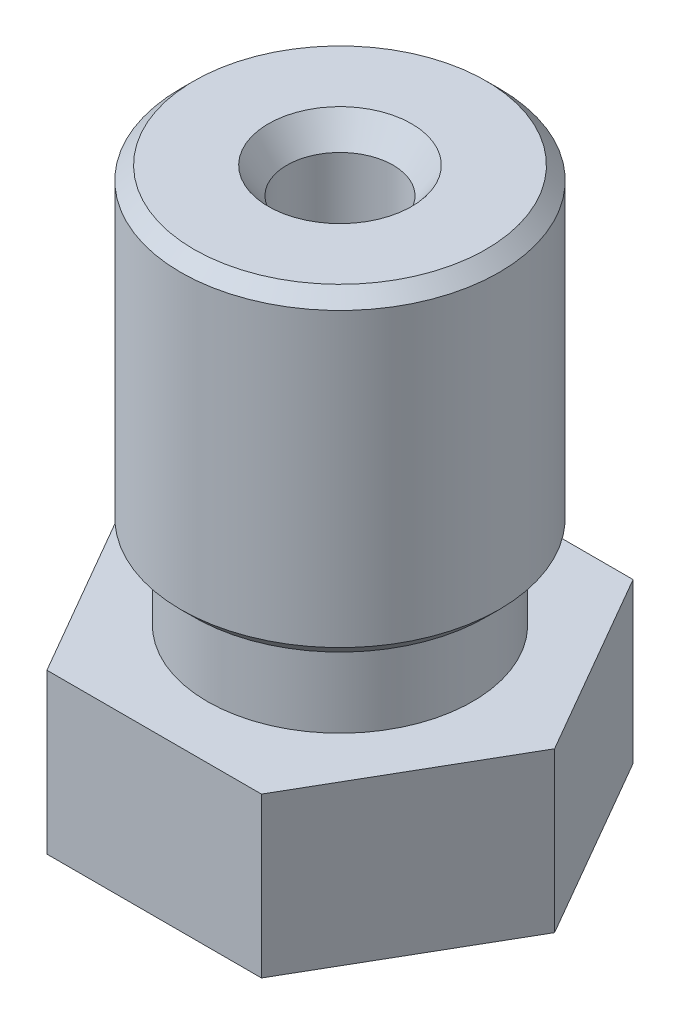
ISO-10303-21;
HEADER;
FILE_DESCRIPTION(('STEP AP214'),'2;1');
FILE_NAME('part.step','',(''),(''),'','','');
FILE_SCHEMA(('AUTOMOTIVE_DESIGN { 1 0 10303 214 1 1 1 1 }'));
ENDSEC;
DATA;
#1=APPLICATION_CONTEXT('core data for automotive mechanical design processes');
#2=APPLICATION_PROTOCOL_DEFINITION('international standard','automotive_design',2000,#1);
#3=PRODUCT_CONTEXT('',#1,'mechanical');
#4=PRODUCT('Part','Part','',(#3));
#5=PRODUCT_RELATED_PRODUCT_CATEGORY('part','',(#4));
#6=PRODUCT_DEFINITION_FORMATION('','',#4);
#7=PRODUCT_DEFINITION_CONTEXT('part definition',#1,'design');
#8=PRODUCT_DEFINITION('design','',#6,#7);
#9=PRODUCT_DEFINITION_SHAPE('','',#8);
#10=(LENGTH_UNIT() NAMED_UNIT(*) SI_UNIT(.MILLI.,.METRE.));
#11=(NAMED_UNIT(*) PLANE_ANGLE_UNIT() SI_UNIT($,.RADIAN.));
#12=(NAMED_UNIT(*) SI_UNIT($,.STERADIAN.) SOLID_ANGLE_UNIT());
#13=UNCERTAINTY_MEASURE_WITH_UNIT(LENGTH_MEASURE(1.E-05),#10,'distance_accuracy_value','');
#14=(GEOMETRIC_REPRESENTATION_CONTEXT(3) GLOBAL_UNCERTAINTY_ASSIGNED_CONTEXT((#13)) GLOBAL_UNIT_ASSIGNED_CONTEXT((#10,
#11,#12)) REPRESENTATION_CONTEXT('',''));
#15=CARTESIAN_POINT('',(0.,0.,0.));
#16=DIRECTION('',(0.,0.,1.));
#17=DIRECTION('',(1.,0.,0.));
#18=AXIS2_PLACEMENT_3D('',#15,#16,#17);
#19=CARTESIAN_POINT('',(0.5,-6.25,0.));
#20=DIRECTION('',(0.,-1.,0.));
#21=DIRECTION('',(0.,0.,-1.));
#22=AXIS2_PLACEMENT_3D('',#19,#20,#21);
#23=PLANE('',#22);
#24=CARTESIAN_POINT('',(0.,-6.25,0.));
#25=DIRECTION('',(0.,-1.,0.));
#26=DIRECTION('',(0.,0.,-1.));
#27=AXIS2_PLACEMENT_3D('',#24,#25,#26);
#28=CIRCLE('',#27,0.5);
#29=CARTESIAN_POINT('',(0.,-6.25,-0.5));
#30=VERTEX_POINT('',#29);
#31=EDGE_CURVE('E126',#30,#30,#28,.T.);
#32=ORIENTED_EDGE('',*,*,#31,.T.);
#33=EDGE_LOOP('',(#32));
#34=FACE_BOUND('',#33,.T.);
#35=CARTESIAN_POINT('',(0.,-6.25,0.));
#36=DIRECTION('',(0.,-1.,0.));
#37=DIRECTION('',(0.,0.,-1.));
#38=AXIS2_PLACEMENT_3D('',#35,#36,#37);
#39=CIRCLE('',#38,0.2);
#40=CARTESIAN_POINT('',(0.,-6.25,-0.2));
#41=VERTEX_POINT('',#40);
#42=EDGE_CURVE('E157',#41,#41,#39,.T.);
#43=ORIENTED_EDGE('',*,*,#42,.F.);
#44=EDGE_LOOP('',(#43));
#45=FACE_BOUND('',#44,.T.);
#46=ADVANCED_FACE('F35',(#34,#45),#23,.T.);
#47=CARTESIAN_POINT('',(0.,-6.25,0.));
#48=DIRECTION('',(0.,-1.,0.));
#49=DIRECTION('',(0.,0.,-1.));
#50=AXIS2_PLACEMENT_3D('',#47,#48,#49);
#51=CYLINDRICAL_SURFACE('',#50,0.2);
#52=ORIENTED_EDGE('',*,*,#42,.T.);
#53=EDGE_LOOP('',(#52));
#54=FACE_BOUND('',#53,.T.);
#55=CARTESIAN_POINT('',(0.,-5.45,0.));
#56=DIRECTION('',(0.,-1.,0.));
#57=DIRECTION('',(0.,0.,-1.));
#58=AXIS2_PLACEMENT_3D('',#55,#56,#57);
#59=CIRCLE('',#58,0.2);
#60=CARTESIAN_POINT('',(0.,-5.45,-0.2));
#61=VERTEX_POINT('',#60);
#62=EDGE_CURVE('E154',#61,#61,#59,.T.);
#63=ORIENTED_EDGE('',*,*,#62,.F.);
#64=EDGE_LOOP('',(#63));
#65=FACE_BOUND('',#64,.T.);
#66=ADVANCED_FACE('F199',(#54,#65),#51,.F.);
#67=CARTESIAN_POINT('',(0.,-5.20512422308031,0.));
#68=DIRECTION('',(0.,1.,0.));
#69=DIRECTION('',(0.,0.,1.));
#70=AXIS2_PLACEMENT_3D('',#67,#68,#69);
#71=CONICAL_SURFACE('',#70,0.75,1.15191730631626);
#72=ORIENTED_EDGE('',*,*,#62,.T.);
#73=EDGE_LOOP('',(#72));
#74=FACE_BOUND('',#73,.T.);
#75=CARTESIAN_POINT('',(0.,-5.20512422308031,0.));
#76=DIRECTION('',(0.,-1.,0.));
#77=DIRECTION('',(0.,0.,-1.));
#78=AXIS2_PLACEMENT_3D('',#75,#76,#77);
#79=CIRCLE('',#78,0.75);
#80=CARTESIAN_POINT('',(0.,-5.20512422308031,-0.75));
#81=VERTEX_POINT('',#80);
#82=EDGE_CURVE('E151',#81,#81,#79,.T.);
#83=ORIENTED_EDGE('',*,*,#82,.F.);
#84=EDGE_LOOP('',(#83));
#85=FACE_BOUND('',#84,.T.);
#86=ADVANCED_FACE('F205',(#74,#85),#71,.F.);
#87=CARTESIAN_POINT('',(0.,-6.25,0.));
#88=DIRECTION('',(0.,-1.,0.));
#89=DIRECTION('',(0.,0.,-1.));
#90=AXIS2_PLACEMENT_3D('',#87,#88,#89);
#91=CYLINDRICAL_SURFACE('',#90,0.75);
#92=ORIENTED_EDGE('',*,*,#82,.T.);
#93=EDGE_LOOP('',(#92));
#94=FACE_BOUND('',#93,.T.);
#95=CARTESIAN_POINT('',(0.,-4.3613071713494,0.));
#96=DIRECTION('',(0.,-1.,0.));
#97=DIRECTION('',(0.,0.,-1.));
#98=AXIS2_PLACEMENT_3D('',#95,#96,#97);
#99=CIRCLE('',#98,0.75);
#100=CARTESIAN_POINT('',(0.,-4.3613071713494,-0.75));
#101=VERTEX_POINT('',#100);
#102=EDGE_CURVE('E148',#101,#101,#99,.T.);
#103=ORIENTED_EDGE('',*,*,#102,.F.);
#104=EDGE_LOOP('',(#103));
#105=FACE_BOUND('',#104,.T.);
#106=ADVANCED_FACE('F212',(#94,#105),#91,.F.);
#107=CARTESIAN_POINT('',(0.,-4.25,0.));
#108=DIRECTION('',(0.,1.,0.));
#109=DIRECTION('',(0.,0.,1.));
#110=AXIS2_PLACEMENT_3D('',#107,#108,#109);
#111=CONICAL_SURFACE('',#110,1.00000000005,1.15191730631626);
#112=ORIENTED_EDGE('',*,*,#102,.T.);
#113=EDGE_LOOP('',(#112));
#114=FACE_BOUND('',#113,.T.);
#115=CARTESIAN_POINT('',(0.,-4.25,0.));
#116=DIRECTION('',(0.,-1.,0.));
#117=DIRECTION('',(0.,0.,-1.));
#118=AXIS2_PLACEMENT_3D('',#115,#116,#117);
#119=CIRCLE('',#118,1.00000000005);
#120=CARTESIAN_POINT('',(0.,-4.25,-1.00000000005));
#121=VERTEX_POINT('',#120);
#122=EDGE_CURVE('E145',#121,#121,#119,.T.);
#123=ORIENTED_EDGE('',*,*,#122,.F.);
#124=EDGE_LOOP('',(#123));
#125=FACE_BOUND('',#124,.T.);
#126=ADVANCED_FACE('F216',(#114,#125),#111,.F.);
#127=CARTESIAN_POINT('',(0.,-6.25,0.));
#128=DIRECTION('',(0.,-1.,0.));
#129=DIRECTION('',(0.,0.,-1.));
#130=AXIS2_PLACEMENT_3D('',#127,#128,#129);
#131=CYLINDRICAL_SURFACE('',#130,1.00000000005);
#132=ORIENTED_EDGE('',*,*,#122,.T.);
#133=EDGE_LOOP('',(#132));
#134=FACE_BOUND('',#133,.T.);
#135=CARTESIAN_POINT('',(0.,5.75,0.));
#136=DIRECTION('',(0.,-1.,0.));
#137=DIRECTION('',(0.,0.,-1.));
#138=AXIS2_PLACEMENT_3D('',#135,#136,#137);
#139=CIRCLE('',#138,1.00000000005);
#140=CARTESIAN_POINT('',(0.,5.75,-1.00000000005));
#141=VERTEX_POINT('',#140);
#142=EDGE_CURVE('E142',#141,#141,#139,.T.);
#143=ORIENTED_EDGE('',*,*,#142,.F.);
#144=EDGE_LOOP('',(#143));
#145=FACE_BOUND('',#144,.T.);
#146=ADVANCED_FACE('F220',(#134,#145),#131,.F.);
#147=CARTESIAN_POINT('',(0.,6.25,0.));
#148=DIRECTION('',(0.,1.,0.));
#149=DIRECTION('',(0.,0.,1.));
#150=AXIS2_PLACEMENT_3D('',#147,#148,#149);
#151=CONICAL_SURFACE('',#150,1.35010376915485,0.610865238198013);
#152=ORIENTED_EDGE('',*,*,#142,.T.);
#153=EDGE_LOOP('',(#152));
#154=FACE_BOUND('',#153,.T.);
#155=CARTESIAN_POINT('',(0.,6.25,0.));
#156=DIRECTION('',(0.,-1.,0.));
#157=DIRECTION('',(0.,0.,-1.));
#158=AXIS2_PLACEMENT_3D('',#155,#156,#157);
#159=CIRCLE('',#158,1.35010376915485);
#160=CARTESIAN_POINT('',(0.,6.25,-1.35010376915485));
#161=VERTEX_POINT('',#160);
#162=EDGE_CURVE('E139',#161,#161,#159,.T.);
#163=ORIENTED_EDGE('',*,*,#162,.F.);
#164=EDGE_LOOP('',(#163));
#165=FACE_BOUND('',#164,.T.);
#166=ADVANCED_FACE('F224',(#154,#165),#151,.F.);
#167=CARTESIAN_POINT('',(1.35010376915485,6.25,0.));
#168=DIRECTION('',(0.,1.,0.));
#169=DIRECTION('',(0.,0.,1.));
#170=AXIS2_PLACEMENT_3D('',#167,#168,#169);
#171=PLANE('',#170);
#172=CARTESIAN_POINT('',(0.,6.25,0.));
#173=DIRECTION('',(0.,1.,0.));
#174=DIRECTION('',(0.,0.,1.));
#175=AXIS2_PLACEMENT_3D('',#172,#173,#174);
#176=CIRCLE('',#175,2.75);
#177=CARTESIAN_POINT('',(0.,6.25,2.75));
#178=VERTEX_POINT('',#177);
#179=EDGE_CURVE('E11',#178,#178,#176,.T.);
#180=ORIENTED_EDGE('',*,*,#179,.T.);
#181=EDGE_LOOP('',(#180));
#182=FACE_BOUND('',#181,.T.);
#183=ORIENTED_EDGE('',*,*,#162,.T.);
#184=EDGE_LOOP('',(#183));
#185=FACE_BOUND('',#184,.T.);
#186=ADVANCED_FACE('F228',(#182,#185),#171,.T.);
#187=CARTESIAN_POINT('',(0.,-6.25,0.));
#188=DIRECTION('',(0.,-1.,0.));
#189=DIRECTION('',(0.,0.,-1.));
#190=AXIS2_PLACEMENT_3D('',#187,#188,#189);
#191=CYLINDRICAL_SURFACE('',#190,3.);
#192=CARTESIAN_POINT('',(0.,0.5,0.));
#193=DIRECTION('',(0.,-1.,0.));
#194=DIRECTION('',(0.,0.,-1.));
#195=AXIS2_PLACEMENT_3D('',#192,#193,#194);
#196=CIRCLE('',#195,3.);
#197=CARTESIAN_POINT('',(0.,0.5,-3.));
#198=VERTEX_POINT('',#197);
#199=EDGE_CURVE('E43',#198,#198,#196,.F.);
#200=ORIENTED_EDGE('',*,*,#199,.T.);
#201=EDGE_LOOP('',(#200));
#202=FACE_BOUND('',#201,.T.);
#203=CARTESIAN_POINT('',(0.,6.,0.));
#204=DIRECTION('',(0.,1.,0.));
#205=DIRECTION('',(0.,0.,1.));
#206=AXIS2_PLACEMENT_3D('',#203,#204,#205);
#207=CIRCLE('',#206,3.);
#208=CARTESIAN_POINT('',(0.,6.,3.));
#209=VERTEX_POINT('',#208);
#210=EDGE_CURVE('E163',#209,#209,#207,.F.);
#211=ORIENTED_EDGE('',*,*,#210,.T.);
#212=EDGE_LOOP('',(#211));
#213=FACE_BOUND('',#212,.T.);
#214=ADVANCED_FACE('F168',(#202,#213),#191,.T.);
#215=CARTESIAN_POINT('',(2.5,0.25,0.));
#216=DIRECTION('',(0.,-1.,0.));
#217=DIRECTION('',(0.,0.,-1.));
#218=AXIS2_PLACEMENT_3D('',#215,#216,#217);
#219=PLANE('',#218);
#220=CARTESIAN_POINT('',(0.,0.25,0.));
#221=DIRECTION('',(0.,-1.,0.));
#222=DIRECTION('',(0.,0.,-1.));
#223=AXIS2_PLACEMENT_3D('',#220,#221,#222);
#224=CIRCLE('',#223,2.75);
#225=CARTESIAN_POINT('',(0.,0.25,-2.75));
#226=VERTEX_POINT('',#225);
#227=EDGE_CURVE('E160',#226,#226,#224,.T.);
#228=ORIENTED_EDGE('',*,*,#227,.T.);
#229=EDGE_LOOP('',(#228));
#230=FACE_BOUND('',#229,.T.);
#231=CARTESIAN_POINT('',(0.,0.25,0.));
#232=DIRECTION('',(0.,-1.,0.));
#233=DIRECTION('',(0.,0.,-1.));
#234=AXIS2_PLACEMENT_3D('',#231,#232,#233);
#235=CIRCLE('',#234,2.5);
#236=CARTESIAN_POINT('',(0.,0.25,-2.5));
#237=VERTEX_POINT('',#236);
#238=EDGE_CURVE('E136',#237,#237,#235,.T.);
#239=ORIENTED_EDGE('',*,*,#238,.F.);
#240=EDGE_LOOP('',(#239));
#241=FACE_BOUND('',#240,.T.);
#242=ADVANCED_FACE('F177',(#230,#241),#219,.T.);
#243=CARTESIAN_POINT('',(0.,-6.25,0.));
#244=DIRECTION('',(0.,-1.,0.));
#245=DIRECTION('',(0.,0.,-1.));
#246=AXIS2_PLACEMENT_3D('',#243,#244,#245);
#247=CYLINDRICAL_SURFACE('',#246,2.5);
#248=ORIENTED_EDGE('',*,*,#238,.T.);
#249=EDGE_LOOP('',(#248));
#250=FACE_BOUND('',#249,.T.);
#251=CARTESIAN_POINT('',(0.,-1.25,0.));
#252=DIRECTION('',(0.,-1.,0.));
#253=DIRECTION('',(0.,0.,-1.));
#254=AXIS2_PLACEMENT_3D('',#251,#252,#253);
#255=CIRCLE('',#254,2.5);
#256=CARTESIAN_POINT('',(0.,-1.25,-2.5));
#257=VERTEX_POINT('',#256);
#258=EDGE_CURVE('E133',#257,#257,#255,.T.);
#259=ORIENTED_EDGE('',*,*,#258,.F.);
#260=EDGE_LOOP('',(#259));
#261=FACE_BOUND('',#260,.T.);
#262=ADVANCED_FACE('F180',(#250,#261),#247,.T.);
#263=CARTESIAN_POINT('',(2.5,-1.25,0.));
#264=DIRECTION('',(0.,1.,0.));
#265=DIRECTION('',(0.,0.,1.));
#266=AXIS2_PLACEMENT_3D('',#263,#264,#265);
#267=PLANE('',#266);
#268=ORIENTED_EDGE('',*,*,#258,.T.);
#269=EDGE_LOOP('',(#268));
#270=FACE_BOUND('',#269,.T.);
#271=DIRECTION('',(-0.5,0.,0.866025403784438));
#272=VECTOR('',#271,1.);
#273=CARTESIAN_POINT('',(4.04145188432738,-1.25,0.));
#274=LINE('',#273,#272);
#275=CARTESIAN_POINT('',(4.04145188432738,-1.25,0.));
#276=VERTEX_POINT('',#275);
#277=CARTESIAN_POINT('',(2.02072594216369,-1.25,3.5));
#278=VERTEX_POINT('',#277);
#279=EDGE_CURVE('E50',#276,#278,#274,.T.);
#280=ORIENTED_EDGE('',*,*,#279,.F.);
#281=DIRECTION('',(0.5,0.,0.866025403784439));
#282=VECTOR('',#281,1.);
#283=CARTESIAN_POINT('',(2.02072594216369,-1.25,-3.5));
#284=LINE('',#283,#282);
#285=CARTESIAN_POINT('',(2.02072594216369,-1.25,-3.5));
#286=VERTEX_POINT('',#285);
#287=EDGE_CURVE('E106',#286,#276,#284,.T.);
#288=ORIENTED_EDGE('',*,*,#287,.F.);
#289=DIRECTION('',(1.,0.,0.));
#290=VECTOR('',#289,1.);
#291=CARTESIAN_POINT('',(-2.02072594216369,-1.25,-3.5));
#292=LINE('',#291,#290);
#293=CARTESIAN_POINT('',(-2.02072594216369,-1.25,-3.5));
#294=VERTEX_POINT('',#293);
#295=EDGE_CURVE('E104',#294,#286,#292,.T.);
#296=ORIENTED_EDGE('',*,*,#295,.F.);
#297=DIRECTION('',(0.5,0.,-0.866025403784439));
#298=VECTOR('',#297,1.);
#299=CARTESIAN_POINT('',(-4.04145188432738,-1.25,0.));
#300=LINE('',#299,#298);
#301=CARTESIAN_POINT('',(-4.04145188432738,-1.25,0.));
#302=VERTEX_POINT('',#301);
#303=EDGE_CURVE('E92',#302,#294,#300,.T.);
#304=ORIENTED_EDGE('',*,*,#303,.F.);
#305=DIRECTION('',(-0.5,0.,-0.866025403784439));
#306=VECTOR('',#305,1.);
#307=CARTESIAN_POINT('',(-2.02072594216369,-1.25,3.5));
#308=LINE('',#307,#306);
#309=CARTESIAN_POINT('',(-2.02072594216369,-1.25,3.5));
#310=VERTEX_POINT('',#309);
#311=EDGE_CURVE('E114',#310,#302,#308,.T.);
#312=ORIENTED_EDGE('',*,*,#311,.F.);
#313=DIRECTION('',(-1.,0.,0.));
#314=VECTOR('',#313,1.);
#315=CARTESIAN_POINT('',(2.02072594216369,-1.25,3.5));
#316=LINE('',#315,#314);
#317=EDGE_CURVE('E58',#278,#310,#316,.T.);
#318=ORIENTED_EDGE('',*,*,#317,.F.);
#319=EDGE_LOOP('',(#280,#288,#296,#304,#312,#318));
#320=FACE_BOUND('',#319,.T.);
#321=ADVANCED_FACE('F105',(#270,#320),#267,.T.);
#322=CARTESIAN_POINT('',(3.5,-4.25,0.));
#323=DIRECTION('',(0.,-1.,0.));
#324=DIRECTION('',(0.,0.,-1.));
#325=AXIS2_PLACEMENT_3D('',#322,#323,#324);
#326=PLANE('',#325);
#327=DIRECTION('',(-0.5,0.,-0.866025403784439));
#328=VECTOR('',#327,1.);
#329=CARTESIAN_POINT('',(-2.02072594216369,-4.25,3.5));
#330=LINE('',#329,#328);
#331=CARTESIAN_POINT('',(-2.02072594216369,-4.25,3.5));
#332=VERTEX_POINT('',#331);
#333=CARTESIAN_POINT('',(-4.04145188432738,-4.25,0.));
#334=VERTEX_POINT('',#333);
#335=EDGE_CURVE('E408',#332,#334,#330,.T.);
#336=ORIENTED_EDGE('',*,*,#335,.T.);
#337=DIRECTION('',(0.5,0.,-0.866025403784439));
#338=VECTOR('',#337,1.);
#339=CARTESIAN_POINT('',(-4.04145188432738,-4.25,0.));
#340=LINE('',#339,#338);
#341=CARTESIAN_POINT('',(-2.02072594216369,-4.25,-3.5));
#342=VERTEX_POINT('',#341);
#343=EDGE_CURVE('E410',#334,#342,#340,.T.);
#344=ORIENTED_EDGE('',*,*,#343,.T.);
#345=DIRECTION('',(1.,0.,0.));
#346=VECTOR('',#345,1.);
#347=CARTESIAN_POINT('',(-2.02072594216369,-4.25,-3.5));
#348=LINE('',#347,#346);
#349=CARTESIAN_POINT('',(2.02072594216369,-4.25,-3.5));
#350=VERTEX_POINT('',#349);
#351=EDGE_CURVE('E113',#342,#350,#348,.T.);
#352=ORIENTED_EDGE('',*,*,#351,.T.);
#353=DIRECTION('',(0.5,0.,0.866025403784439));
#354=VECTOR('',#353,1.);
#355=CARTESIAN_POINT('',(2.02072594216369,-4.25,-3.5));
#356=LINE('',#355,#354);
#357=CARTESIAN_POINT('',(4.04145188432738,-4.25,0.));
#358=VERTEX_POINT('',#357);
#359=EDGE_CURVE('E130',#350,#358,#356,.T.);
#360=ORIENTED_EDGE('',*,*,#359,.T.);
#361=DIRECTION('',(-0.5,0.,0.866025403784438));
#362=VECTOR('',#361,1.);
#363=CARTESIAN_POINT('',(4.04145188432738,-4.25,0.));
#364=LINE('',#363,#362);
#365=CARTESIAN_POINT('',(2.02072594216369,-4.25,3.5));
#366=VERTEX_POINT('',#365);
#367=EDGE_CURVE('E123',#358,#366,#364,.T.);
#368=ORIENTED_EDGE('',*,*,#367,.T.);
#369=DIRECTION('',(-1.,0.,0.));
#370=VECTOR('',#369,1.);
#371=CARTESIAN_POINT('',(2.02072594216369,-4.25,3.5));
#372=LINE('',#371,#370);
#373=EDGE_CURVE('E395',#366,#332,#372,.T.);
#374=ORIENTED_EDGE('',*,*,#373,.T.);
#375=EDGE_LOOP('',(#336,#344,#352,#360,#368,#374));
#376=FACE_BOUND('',#375,.T.);
#377=CARTESIAN_POINT('',(0.,-4.25,0.));
#378=DIRECTION('',(0.,-1.,0.));
#379=DIRECTION('',(0.,0.,-1.));
#380=AXIS2_PLACEMENT_3D('',#377,#378,#379);
#381=CIRCLE('',#380,1.90041507641941);
#382=CARTESIAN_POINT('',(0.,-4.25,-1.90041507641941));
#383=VERTEX_POINT('',#382);
#384=EDGE_CURVE('E129',#383,#383,#381,.T.);
#385=ORIENTED_EDGE('',*,*,#384,.F.);
#386=EDGE_LOOP('',(#385));
#387=FACE_BOUND('',#386,.T.);
#388=ADVANCED_FACE('F190',(#376,#387),#326,.T.);
#389=CARTESIAN_POINT('',(0.,-6.25,0.));
#390=DIRECTION('',(0.,1.,0.));
#391=DIRECTION('',(0.,0.,1.));
#392=AXIS2_PLACEMENT_3D('',#389,#390,#391);
#393=CONICAL_SURFACE('',#392,0.5,0.610865238198013);
#394=ORIENTED_EDGE('',*,*,#384,.T.);
#395=EDGE_LOOP('',(#394));
#396=FACE_BOUND('',#395,.T.);
#397=ORIENTED_EDGE('',*,*,#31,.F.);
#398=EDGE_LOOP('',(#397));
#399=FACE_BOUND('',#398,.T.);
#400=ADVANCED_FACE('F195',(#396,#399),#393,.T.);
#401=CARTESIAN_POINT('',(4.04145188432738,9.44267662156363,0.));
#402=DIRECTION('',(0.866025403784438,0.,0.5));
#403=DIRECTION('',(0.5,0.,-0.866025403784438));
#404=AXIS2_PLACEMENT_3D('',#401,#402,#403);
#405=PLANE('',#404);
#406=ORIENTED_EDGE('',*,*,#279,.T.);
#407=DIRECTION('',(0.,-1.,0.));
#408=VECTOR('',#407,1.);
#409=CARTESIAN_POINT('',(2.02072594216369,9.44267662156363,3.5));
#410=LINE('',#409,#408);
#411=EDGE_CURVE('E124',#278,#366,#410,.T.);
#412=ORIENTED_EDGE('',*,*,#411,.T.);
#413=ORIENTED_EDGE('',*,*,#367,.F.);
#414=DIRECTION('',(0.,-1.,0.));
#415=VECTOR('',#414,1.);
#416=CARTESIAN_POINT('',(4.04145188432738,9.44267662156363,0.));
#417=LINE('',#416,#415);
#418=EDGE_CURVE('E110',#276,#358,#417,.T.);
#419=ORIENTED_EDGE('',*,*,#418,.F.);
#420=EDGE_LOOP('',(#406,#412,#413,#419));
#421=FACE_BOUND('',#420,.T.);
#422=ADVANCED_FACE('F260',(#421),#405,.T.);
#423=CARTESIAN_POINT('',(2.02072594216369,9.44267662156363,-3.5));
#424=DIRECTION('',(0.866025403784439,0.,-0.5));
#425=DIRECTION('',(-0.5,0.,-0.866025403784439));
#426=AXIS2_PLACEMENT_3D('',#423,#424,#425);
#427=PLANE('',#426);
#428=ORIENTED_EDGE('',*,*,#287,.T.);
#429=ORIENTED_EDGE('',*,*,#418,.T.);
#430=ORIENTED_EDGE('',*,*,#359,.F.);
#431=DIRECTION('',(0.,-1.,0.));
#432=VECTOR('',#431,1.);
#433=CARTESIAN_POINT('',(2.02072594216369,9.44267662156363,-3.5));
#434=LINE('',#433,#432);
#435=EDGE_CURVE('E101',#286,#350,#434,.T.);
#436=ORIENTED_EDGE('',*,*,#435,.F.);
#437=EDGE_LOOP('',(#428,#429,#430,#436));
#438=FACE_BOUND('',#437,.T.);
#439=ADVANCED_FACE('F282',(#438),#427,.T.);
#440=CARTESIAN_POINT('',(-2.02072594216369,9.44267662156363,-3.5));
#441=DIRECTION('',(0.,0.,-1.));
#442=DIRECTION('',(-1.,0.,0.));
#443=AXIS2_PLACEMENT_3D('',#440,#441,#442);
#444=PLANE('',#443);
#445=ORIENTED_EDGE('',*,*,#295,.T.);
#446=ORIENTED_EDGE('',*,*,#435,.T.);
#447=ORIENTED_EDGE('',*,*,#351,.F.);
#448=DIRECTION('',(0.,-1.,0.));
#449=VECTOR('',#448,1.);
#450=CARTESIAN_POINT('',(-2.02072594216369,9.44267662156363,-3.5));
#451=LINE('',#450,#449);
#452=EDGE_CURVE('E96',#294,#342,#451,.T.);
#453=ORIENTED_EDGE('',*,*,#452,.F.);
#454=EDGE_LOOP('',(#445,#446,#447,#453));
#455=FACE_BOUND('',#454,.T.);
#456=ADVANCED_FACE('F112',(#455),#444,.T.);
#457=CARTESIAN_POINT('',(-4.04145188432738,9.44267662156363,0.));
#458=DIRECTION('',(-0.866025403784439,0.,-0.5));
#459=DIRECTION('',(-0.5,0.,0.866025403784439));
#460=AXIS2_PLACEMENT_3D('',#457,#458,#459);
#461=PLANE('',#460);
#462=ORIENTED_EDGE('',*,*,#303,.T.);
#463=ORIENTED_EDGE('',*,*,#452,.T.);
#464=ORIENTED_EDGE('',*,*,#343,.F.);
#465=DIRECTION('',(0.,-1.,0.));
#466=VECTOR('',#465,1.);
#467=CARTESIAN_POINT('',(-4.04145188432738,9.44267662156363,0.));
#468=LINE('',#467,#466);
#469=EDGE_CURVE('E99',#302,#334,#468,.T.);
#470=ORIENTED_EDGE('',*,*,#469,.F.);
#471=EDGE_LOOP('',(#462,#463,#464,#470));
#472=FACE_BOUND('',#471,.T.);
#473=ADVANCED_FACE('F94',(#472),#461,.T.);
#474=CARTESIAN_POINT('',(-2.02072594216369,9.44267662156363,3.5));
#475=DIRECTION('',(-0.866025403784439,0.,0.5));
#476=DIRECTION('',(0.5,0.,0.866025403784439));
#477=AXIS2_PLACEMENT_3D('',#474,#475,#476);
#478=PLANE('',#477);
#479=ORIENTED_EDGE('',*,*,#311,.T.);
#480=ORIENTED_EDGE('',*,*,#469,.T.);
#481=ORIENTED_EDGE('',*,*,#335,.F.);
#482=DIRECTION('',(0.,-1.,0.));
#483=VECTOR('',#482,1.);
#484=CARTESIAN_POINT('',(-2.02072594216369,9.44267662156363,3.5));
#485=LINE('',#484,#483);
#486=EDGE_CURVE('E121',#310,#332,#485,.T.);
#487=ORIENTED_EDGE('',*,*,#486,.F.);
#488=EDGE_LOOP('',(#479,#480,#481,#487));
#489=FACE_BOUND('',#488,.T.);
#490=ADVANCED_FACE('F308',(#489),#478,.T.);
#491=CARTESIAN_POINT('',(2.02072594216369,9.44267662156363,3.5));
#492=DIRECTION('',(0.,0.,1.));
#493=DIRECTION('',(1.,0.,0.));
#494=AXIS2_PLACEMENT_3D('',#491,#492,#493);
#495=PLANE('',#494);
#496=ORIENTED_EDGE('',*,*,#317,.T.);
#497=ORIENTED_EDGE('',*,*,#486,.T.);
#498=ORIENTED_EDGE('',*,*,#373,.F.);
#499=ORIENTED_EDGE('',*,*,#411,.F.);
#500=EDGE_LOOP('',(#496,#497,#498,#499));
#501=FACE_BOUND('',#500,.T.);
#502=ADVANCED_FACE('F174',(#501),#495,.T.);
#503=CARTESIAN_POINT('',(0.,0.25,0.));
#504=DIRECTION('',(0.,1.,0.));
#505=DIRECTION('',(0.,0.,1.));
#506=AXIS2_PLACEMENT_3D('',#503,#504,#505);
#507=CONICAL_SURFACE('',#506,2.75,0.785398163397444);
#508=ORIENTED_EDGE('',*,*,#199,.F.);
#509=EDGE_LOOP('',(#508));
#510=FACE_BOUND('',#509,.T.);
#511=ORIENTED_EDGE('',*,*,#227,.F.);
#512=EDGE_LOOP('',(#511));
#513=FACE_BOUND('',#512,.T.);
#514=ADVANCED_FACE('F171',(#510,#513),#507,.T.);
#515=CARTESIAN_POINT('',(0.,6.,0.));
#516=DIRECTION('',(0.,-1.,0.));
#517=DIRECTION('',(0.,0.,-1.));
#518=AXIS2_PLACEMENT_3D('',#515,#516,#517);
#519=CONICAL_SURFACE('',#518,3.,0.785398163397447);
#520=ORIENTED_EDGE('',*,*,#179,.F.);
#521=EDGE_LOOP('',(#520));
#522=FACE_BOUND('',#521,.T.);
#523=ORIENTED_EDGE('',*,*,#210,.F.);
#524=EDGE_LOOP('',(#523));
#525=FACE_BOUND('',#524,.T.);
#526=ADVANCED_FACE('F37',(#522,#525),#519,.T.);
#527=CLOSED_SHELL('',(#46,#66,#86,#106,#126,#146,#166,#186,#214,#242,#262,#321,#388,#400,#422,
#439,#456,#473,#490,#502,#514,#526));
#528=MANIFOLD_SOLID_BREP('B2',#527);
#529=ADVANCED_BREP_SHAPE_REPRESENTATION('',(#18,#528),#14);
#530=SHAPE_DEFINITION_REPRESENTATION(#9,#529);
ENDSEC;
END-ISO-10303-21;
